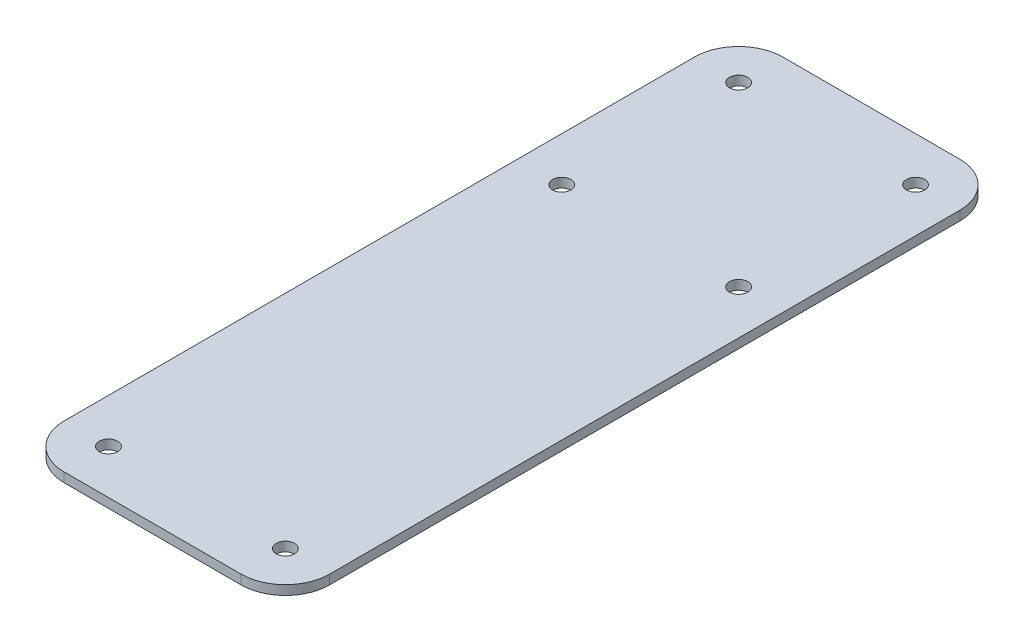
ISO-10303-21;
HEADER;
FILE_DESCRIPTION(('STEP AP214'),'2;1');
FILE_NAME('part.step','',(''),(''),'','','');
FILE_SCHEMA(('AUTOMOTIVE_DESIGN { 1 0 10303 214 1 1 1 1 }'));
ENDSEC;
DATA;
#1=APPLICATION_CONTEXT('core data for automotive mechanical design processes');
#2=APPLICATION_PROTOCOL_DEFINITION('international standard','automotive_design',2000,#1);
#3=PRODUCT_CONTEXT('',#1,'mechanical');
#4=PRODUCT('Part','Part','',(#3));
#5=PRODUCT_RELATED_PRODUCT_CATEGORY('part','',(#4));
#6=PRODUCT_DEFINITION_FORMATION('','',#4);
#7=PRODUCT_DEFINITION_CONTEXT('part definition',#1,'design');
#8=PRODUCT_DEFINITION('design','',#6,#7);
#9=PRODUCT_DEFINITION_SHAPE('','',#8);
#10=(LENGTH_UNIT() NAMED_UNIT(*) SI_UNIT(.MILLI.,.METRE.));
#11=(NAMED_UNIT(*) PLANE_ANGLE_UNIT() SI_UNIT($,.RADIAN.));
#12=(NAMED_UNIT(*) SI_UNIT($,.STERADIAN.) SOLID_ANGLE_UNIT());
#13=UNCERTAINTY_MEASURE_WITH_UNIT(LENGTH_MEASURE(1.E-05),#10,'distance_accuracy_value','');
#14=(GEOMETRIC_REPRESENTATION_CONTEXT(3) GLOBAL_UNCERTAINTY_ASSIGNED_CONTEXT((#13)) GLOBAL_UNIT_ASSIGNED_CONTEXT((#10,
#11,#12)) REPRESENTATION_CONTEXT('',''));
#15=CARTESIAN_POINT('',(0.,0.,0.));
#16=DIRECTION('',(0.,0.,1.));
#17=DIRECTION('',(1.,0.,0.));
#18=AXIS2_PLACEMENT_3D('',#15,#16,#17);
#19=CARTESIAN_POINT('',(30.,-169.175,183.7293));
#20=DIRECTION('',(0.,1.,0.));
#21=DIRECTION('',(-1.,0.,0.));
#22=AXIS2_PLACEMENT_3D('',#19,#20,#21);
#23=PLANE('',#22);
#24=CARTESIAN_POINT('',(30.,-169.175,183.7293));
#25=DIRECTION('',(0.,-1.,0.));
#26=DIRECTION('',(-1.,0.,0.));
#27=AXIS2_PLACEMENT_3D('',#24,#25,#26);
#28=CIRCLE('',#27,15.);
#29=CARTESIAN_POINT('',(45.,-169.175,183.7293));
#30=VERTEX_POINT('',#29);
#31=CARTESIAN_POINT('',(30.,-169.175,198.7293));
#32=VERTEX_POINT('',#31);
#33=EDGE_CURVE('E147',#30,#32,#28,.T.);
#34=ORIENTED_EDGE('',*,*,#33,.T.);
#35=DIRECTION('',(-1.,0.,0.));
#36=VECTOR('',#35,1.);
#37=CARTESIAN_POINT('',(30.,-169.175,198.7293));
#38=LINE('',#37,#36);
#39=CARTESIAN_POINT('',(-30.,-169.175,198.7293));
#40=VERTEX_POINT('',#39);
#41=EDGE_CURVE('E95',#32,#40,#38,.T.);
#42=ORIENTED_EDGE('',*,*,#41,.T.);
#43=CARTESIAN_POINT('',(-30.,-169.175,183.7293));
#44=DIRECTION('',(0.,-1.,0.));
#45=DIRECTION('',(-1.,0.,0.));
#46=AXIS2_PLACEMENT_3D('',#43,#44,#45);
#47=CIRCLE('',#46,15.);
#48=CARTESIAN_POINT('',(-45.,-169.175,183.7293));
#49=VERTEX_POINT('',#48);
#50=EDGE_CURVE('E162',#40,#49,#47,.T.);
#51=ORIENTED_EDGE('',*,*,#50,.T.);
#52=DIRECTION('',(0.,0.,-1.));
#53=VECTOR('',#52,1.);
#54=CARTESIAN_POINT('',(-45.,-169.175,-30.));
#55=LINE('',#54,#53);
#56=CARTESIAN_POINT('',(-45.,-169.175,-30.));
#57=VERTEX_POINT('',#56);
#58=EDGE_CURVE('E175',#49,#57,#55,.T.);
#59=ORIENTED_EDGE('',*,*,#58,.T.);
#60=CARTESIAN_POINT('',(-30.,-169.175,-30.));
#61=DIRECTION('',(0.,-1.,0.));
#62=DIRECTION('',(1.,0.,0.));
#63=AXIS2_PLACEMENT_3D('',#60,#61,#62);
#64=CIRCLE('',#63,15.);
#65=CARTESIAN_POINT('',(-30.,-169.175,-45.));
#66=VERTEX_POINT('',#65);
#67=EDGE_CURVE('E114',#57,#66,#64,.T.);
#68=ORIENTED_EDGE('',*,*,#67,.T.);
#69=DIRECTION('',(1.,0.,0.));
#70=VECTOR('',#69,1.);
#71=CARTESIAN_POINT('',(-30.,-169.175,-45.));
#72=LINE('',#71,#70);
#73=CARTESIAN_POINT('',(30.,-169.175,-45.));
#74=VERTEX_POINT('',#73);
#75=EDGE_CURVE('E108',#66,#74,#72,.T.);
#76=ORIENTED_EDGE('',*,*,#75,.T.);
#77=CARTESIAN_POINT('',(30.,-169.175,-30.));
#78=DIRECTION('',(0.,-1.,0.));
#79=DIRECTION('',(1.,0.,0.));
#80=AXIS2_PLACEMENT_3D('',#77,#78,#79);
#81=CIRCLE('',#80,15.);
#82=CARTESIAN_POINT('',(45.,-169.175,-30.));
#83=VERTEX_POINT('',#82);
#84=EDGE_CURVE('E112',#74,#83,#81,.T.);
#85=ORIENTED_EDGE('',*,*,#84,.T.);
#86=DIRECTION('',(0.,0.,1.));
#87=VECTOR('',#86,1.);
#88=CARTESIAN_POINT('',(45.,-169.175,183.7293));
#89=LINE('',#88,#87);
#90=EDGE_CURVE('E52',#83,#30,#89,.T.);
#91=ORIENTED_EDGE('',*,*,#90,.T.);
#92=EDGE_LOOP('',(#34,#42,#51,#59,#68,#76,#85,#91));
#93=FACE_BOUND('',#92,.T.);
#94=CARTESIAN_POINT('',(30.,-169.175,183.7293));
#95=DIRECTION('',(0.,-1.,0.));
#96=DIRECTION('',(1.,0.,0.));
#97=AXIS2_PLACEMENT_3D('',#94,#95,#96);
#98=CIRCLE('',#97,3.09999999999999);
#99=CARTESIAN_POINT('',(33.1,-169.175,183.7293));
#100=VERTEX_POINT('',#99);
#101=EDGE_CURVE('E136',#100,#100,#98,.T.);
#102=ORIENTED_EDGE('',*,*,#101,.F.);
#103=EDGE_LOOP('',(#102));
#104=FACE_BOUND('',#103,.T.);
#105=CARTESIAN_POINT('',(30.,-169.175,-30.));
#106=DIRECTION('',(0.,-1.,0.));
#107=DIRECTION('',(1.,0.,0.));
#108=AXIS2_PLACEMENT_3D('',#105,#106,#107);
#109=CIRCLE('',#108,3.1);
#110=CARTESIAN_POINT('',(33.1,-169.175,-30.));
#111=VERTEX_POINT('',#110);
#112=EDGE_CURVE('E184',#111,#111,#109,.T.);
#113=ORIENTED_EDGE('',*,*,#112,.F.);
#114=EDGE_LOOP('',(#113));
#115=FACE_BOUND('',#114,.T.);
#116=CARTESIAN_POINT('',(-30.,-169.175,-30.));
#117=DIRECTION('',(0.,-1.,0.));
#118=DIRECTION('',(1.,0.,0.));
#119=AXIS2_PLACEMENT_3D('',#116,#117,#118);
#120=CIRCLE('',#119,3.1);
#121=CARTESIAN_POINT('',(-26.9,-169.175,-30.));
#122=VERTEX_POINT('',#121);
#123=EDGE_CURVE('E190',#122,#122,#120,.T.);
#124=ORIENTED_EDGE('',*,*,#123,.F.);
#125=EDGE_LOOP('',(#124));
#126=FACE_BOUND('',#125,.T.);
#127=CARTESIAN_POINT('',(-30.,-169.175,30.));
#128=DIRECTION('',(0.,-1.,0.));
#129=DIRECTION('',(1.,0.,0.));
#130=AXIS2_PLACEMENT_3D('',#127,#128,#129);
#131=CIRCLE('',#130,3.1);
#132=CARTESIAN_POINT('',(-26.9,-169.175,30.));
#133=VERTEX_POINT('',#132);
#134=EDGE_CURVE('E196',#133,#133,#131,.T.);
#135=ORIENTED_EDGE('',*,*,#134,.F.);
#136=EDGE_LOOP('',(#135));
#137=FACE_BOUND('',#136,.T.);
#138=CARTESIAN_POINT('',(30.,-169.175,30.));
#139=DIRECTION('',(0.,-1.,0.));
#140=DIRECTION('',(1.,0.,0.));
#141=AXIS2_PLACEMENT_3D('',#138,#139,#140);
#142=CIRCLE('',#141,3.1);
#143=CARTESIAN_POINT('',(33.1,-169.175,30.));
#144=VERTEX_POINT('',#143);
#145=EDGE_CURVE('E202',#144,#144,#142,.T.);
#146=ORIENTED_EDGE('',*,*,#145,.F.);
#147=EDGE_LOOP('',(#146));
#148=FACE_BOUND('',#147,.T.);
#149=CARTESIAN_POINT('',(-30.,-169.175,183.7293));
#150=DIRECTION('',(0.,-1.,0.));
#151=DIRECTION('',(1.,0.,0.));
#152=AXIS2_PLACEMENT_3D('',#149,#150,#151);
#153=CIRCLE('',#152,3.09999999999999);
#154=CARTESIAN_POINT('',(-26.9,-169.175,183.7293));
#155=VERTEX_POINT('',#154);
#156=EDGE_CURVE('E208',#155,#155,#153,.T.);
#157=ORIENTED_EDGE('',*,*,#156,.F.);
#158=EDGE_LOOP('',(#157));
#159=FACE_BOUND('',#158,.T.);
#160=ADVANCED_FACE('F35',(#93,#104,#115,#126,#137,#148,#159),#23,.F.);
#161=CARTESIAN_POINT('',(30.,-166.,183.7293));
#162=DIRECTION('',(0.,1.,0.));
#163=DIRECTION('',(-1.,0.,0.));
#164=AXIS2_PLACEMENT_3D('',#161,#162,#163);
#165=PLANE('',#164);
#166=CARTESIAN_POINT('',(30.,-166.,30.));
#167=DIRECTION('',(0.,-1.,0.));
#168=DIRECTION('',(1.,0.,0.));
#169=AXIS2_PLACEMENT_3D('',#166,#167,#168);
#170=CIRCLE('',#169,3.1);
#171=CARTESIAN_POINT('',(33.1,-166.,30.));
#172=VERTEX_POINT('',#171);
#173=EDGE_CURVE('E205',#172,#172,#170,.T.);
#174=ORIENTED_EDGE('',*,*,#173,.T.);
#175=EDGE_LOOP('',(#174));
#176=FACE_BOUND('',#175,.T.);
#177=CARTESIAN_POINT('',(-30.,-166.,-30.));
#178=DIRECTION('',(0.,-1.,0.));
#179=DIRECTION('',(1.,0.,0.));
#180=AXIS2_PLACEMENT_3D('',#177,#178,#179);
#181=CIRCLE('',#180,3.1);
#182=CARTESIAN_POINT('',(-26.9,-166.,-30.));
#183=VERTEX_POINT('',#182);
#184=EDGE_CURVE('E193',#183,#183,#181,.T.);
#185=ORIENTED_EDGE('',*,*,#184,.T.);
#186=EDGE_LOOP('',(#185));
#187=FACE_BOUND('',#186,.T.);
#188=CARTESIAN_POINT('',(30.,-166.,183.7293));
#189=DIRECTION('',(0.,-1.,0.));
#190=DIRECTION('',(1.,0.,0.));
#191=AXIS2_PLACEMENT_3D('',#188,#189,#190);
#192=CIRCLE('',#191,3.09999999999999);
#193=CARTESIAN_POINT('',(33.1,-166.,183.7293));
#194=VERTEX_POINT('',#193);
#195=EDGE_CURVE('E181',#194,#194,#192,.T.);
#196=ORIENTED_EDGE('',*,*,#195,.T.);
#197=EDGE_LOOP('',(#196));
#198=FACE_BOUND('',#197,.T.);
#199=CARTESIAN_POINT('',(30.,-166.,183.7293));
#200=DIRECTION('',(0.,-1.,0.));
#201=DIRECTION('',(-1.,0.,0.));
#202=AXIS2_PLACEMENT_3D('',#199,#200,#201);
#203=CIRCLE('',#202,15.);
#204=CARTESIAN_POINT('',(45.,-166.,183.7293));
#205=VERTEX_POINT('',#204);
#206=CARTESIAN_POINT('',(30.,-166.,198.7293));
#207=VERTEX_POINT('',#206);
#208=EDGE_CURVE('E132',#205,#207,#203,.T.);
#209=ORIENTED_EDGE('',*,*,#208,.F.);
#210=DIRECTION('',(0.,0.,1.));
#211=VECTOR('',#210,1.);
#212=CARTESIAN_POINT('',(45.,-166.,183.7293));
#213=LINE('',#212,#211);
#214=CARTESIAN_POINT('',(45.,-166.,-30.));
#215=VERTEX_POINT('',#214);
#216=EDGE_CURVE('E87',#215,#205,#213,.T.);
#217=ORIENTED_EDGE('',*,*,#216,.F.);
#218=CARTESIAN_POINT('',(30.,-166.,-30.));
#219=DIRECTION('',(0.,-1.,0.));
#220=DIRECTION('',(1.,0.,0.));
#221=AXIS2_PLACEMENT_3D('',#218,#219,#220);
#222=CIRCLE('',#221,15.);
#223=CARTESIAN_POINT('',(30.,-166.,-45.));
#224=VERTEX_POINT('',#223);
#225=EDGE_CURVE('E81',#224,#215,#222,.T.);
#226=ORIENTED_EDGE('',*,*,#225,.F.);
#227=DIRECTION('',(1.,0.,0.));
#228=VECTOR('',#227,1.);
#229=CARTESIAN_POINT('',(-30.,-166.,-45.));
#230=LINE('',#229,#228);
#231=CARTESIAN_POINT('',(-30.,-166.,-45.));
#232=VERTEX_POINT('',#231);
#233=EDGE_CURVE('E122',#232,#224,#230,.T.);
#234=ORIENTED_EDGE('',*,*,#233,.F.);
#235=CARTESIAN_POINT('',(-30.,-166.,-30.));
#236=DIRECTION('',(0.,-1.,0.));
#237=DIRECTION('',(1.,0.,0.));
#238=AXIS2_PLACEMENT_3D('',#235,#236,#237);
#239=CIRCLE('',#238,15.);
#240=CARTESIAN_POINT('',(-45.,-166.,-30.));
#241=VERTEX_POINT('',#240);
#242=EDGE_CURVE('E142',#241,#232,#239,.T.);
#243=ORIENTED_EDGE('',*,*,#242,.F.);
#244=DIRECTION('',(0.,0.,-1.));
#245=VECTOR('',#244,1.);
#246=CARTESIAN_POINT('',(-45.,-166.,-30.));
#247=LINE('',#246,#245);
#248=CARTESIAN_POINT('',(-45.,-166.,183.7293));
#249=VERTEX_POINT('',#248);
#250=EDGE_CURVE('E140',#249,#241,#247,.T.);
#251=ORIENTED_EDGE('',*,*,#250,.F.);
#252=CARTESIAN_POINT('',(-30.,-166.,183.7293));
#253=DIRECTION('',(0.,-1.,0.));
#254=DIRECTION('',(-1.,0.,0.));
#255=AXIS2_PLACEMENT_3D('',#252,#253,#254);
#256=CIRCLE('',#255,15.);
#257=CARTESIAN_POINT('',(-30.,-166.,198.7293));
#258=VERTEX_POINT('',#257);
#259=EDGE_CURVE('E138',#258,#249,#256,.T.);
#260=ORIENTED_EDGE('',*,*,#259,.F.);
#261=DIRECTION('',(-1.,0.,0.));
#262=VECTOR('',#261,1.);
#263=CARTESIAN_POINT('',(30.,-166.,198.7293));
#264=LINE('',#263,#262);
#265=EDGE_CURVE('E135',#207,#258,#264,.T.);
#266=ORIENTED_EDGE('',*,*,#265,.F.);
#267=EDGE_LOOP('',(#209,#217,#226,#234,#243,#251,#260,#266));
#268=FACE_BOUND('',#267,.T.);
#269=CARTESIAN_POINT('',(30.,-166.,-30.));
#270=DIRECTION('',(0.,-1.,0.));
#271=DIRECTION('',(1.,0.,0.));
#272=AXIS2_PLACEMENT_3D('',#269,#270,#271);
#273=CIRCLE('',#272,3.1);
#274=CARTESIAN_POINT('',(33.1,-166.,-30.));
#275=VERTEX_POINT('',#274);
#276=EDGE_CURVE('E187',#275,#275,#273,.T.);
#277=ORIENTED_EDGE('',*,*,#276,.T.);
#278=EDGE_LOOP('',(#277));
#279=FACE_BOUND('',#278,.T.);
#280=CARTESIAN_POINT('',(-30.,-166.,30.));
#281=DIRECTION('',(0.,-1.,0.));
#282=DIRECTION('',(1.,0.,0.));
#283=AXIS2_PLACEMENT_3D('',#280,#281,#282);
#284=CIRCLE('',#283,3.1);
#285=CARTESIAN_POINT('',(-26.9,-166.,30.));
#286=VERTEX_POINT('',#285);
#287=EDGE_CURVE('E199',#286,#286,#284,.T.);
#288=ORIENTED_EDGE('',*,*,#287,.T.);
#289=EDGE_LOOP('',(#288));
#290=FACE_BOUND('',#289,.T.);
#291=CARTESIAN_POINT('',(-30.,-166.,183.7293));
#292=DIRECTION('',(0.,-1.,0.));
#293=DIRECTION('',(1.,0.,0.));
#294=AXIS2_PLACEMENT_3D('',#291,#292,#293);
#295=CIRCLE('',#294,3.09999999999999);
#296=CARTESIAN_POINT('',(-26.9,-166.,183.7293));
#297=VERTEX_POINT('',#296);
#298=EDGE_CURVE('E211',#297,#297,#295,.T.);
#299=ORIENTED_EDGE('',*,*,#298,.T.);
#300=EDGE_LOOP('',(#299));
#301=FACE_BOUND('',#300,.T.);
#302=ADVANCED_FACE('F166',(#176,#187,#198,#268,#279,#290,#301),#165,.T.);
#303=CARTESIAN_POINT('',(30.,-169.175,183.7293));
#304=DIRECTION('',(0.,1.,0.));
#305=DIRECTION('',(-1.,0.,0.));
#306=AXIS2_PLACEMENT_3D('',#303,#304,#305);
#307=CYLINDRICAL_SURFACE('',#306,15.);
#308=ORIENTED_EDGE('',*,*,#208,.T.);
#309=DIRECTION('',(0.,1.,0.));
#310=VECTOR('',#309,1.);
#311=CARTESIAN_POINT('',(30.,-169.175,198.7293));
#312=LINE('',#311,#310);
#313=EDGE_CURVE('E12',#32,#207,#312,.T.);
#314=ORIENTED_EDGE('',*,*,#313,.F.);
#315=ORIENTED_EDGE('',*,*,#33,.F.);
#316=DIRECTION('',(0.,1.,0.));
#317=VECTOR('',#316,1.);
#318=CARTESIAN_POINT('',(45.,-169.175,183.7293));
#319=LINE('',#318,#317);
#320=EDGE_CURVE('E128',#30,#205,#319,.T.);
#321=ORIENTED_EDGE('',*,*,#320,.T.);
#322=EDGE_LOOP('',(#308,#314,#315,#321));
#323=FACE_BOUND('',#322,.T.);
#324=ADVANCED_FACE('F37',(#323),#307,.T.);
#325=CARTESIAN_POINT('',(30.,-169.175,198.7293));
#326=DIRECTION('',(0.,0.,-1.));
#327=DIRECTION('',(-1.,0.,0.));
#328=AXIS2_PLACEMENT_3D('',#325,#326,#327);
#329=PLANE('',#328);
#330=ORIENTED_EDGE('',*,*,#265,.T.);
#331=DIRECTION('',(0.,1.,0.));
#332=VECTOR('',#331,1.);
#333=CARTESIAN_POINT('',(-30.,-169.175,198.7293));
#334=LINE('',#333,#332);
#335=EDGE_CURVE('E44',#40,#258,#334,.T.);
#336=ORIENTED_EDGE('',*,*,#335,.F.);
#337=ORIENTED_EDGE('',*,*,#41,.F.);
#338=ORIENTED_EDGE('',*,*,#313,.T.);
#339=EDGE_LOOP('',(#330,#336,#337,#338));
#340=FACE_BOUND('',#339,.T.);
#341=ADVANCED_FACE('F243',(#340),#329,.F.);
#342=CARTESIAN_POINT('',(-30.,-169.175,183.7293));
#343=DIRECTION('',(0.,1.,0.));
#344=DIRECTION('',(-1.,0.,0.));
#345=AXIS2_PLACEMENT_3D('',#342,#343,#344);
#346=CYLINDRICAL_SURFACE('',#345,15.);
#347=ORIENTED_EDGE('',*,*,#259,.T.);
#348=DIRECTION('',(0.,1.,0.));
#349=VECTOR('',#348,1.);
#350=CARTESIAN_POINT('',(-45.,-169.175,183.7293));
#351=LINE('',#350,#349);
#352=EDGE_CURVE('E154',#49,#249,#351,.T.);
#353=ORIENTED_EDGE('',*,*,#352,.F.);
#354=ORIENTED_EDGE('',*,*,#50,.F.);
#355=ORIENTED_EDGE('',*,*,#335,.T.);
#356=EDGE_LOOP('',(#347,#353,#354,#355));
#357=FACE_BOUND('',#356,.T.);
#358=ADVANCED_FACE('F160',(#357),#346,.T.);
#359=CARTESIAN_POINT('',(-45.,-169.175,-30.));
#360=DIRECTION('',(1.,0.,0.));
#361=DIRECTION('',(0.,1.,0.));
#362=AXIS2_PLACEMENT_3D('',#359,#360,#361);
#363=PLANE('',#362);
#364=ORIENTED_EDGE('',*,*,#250,.T.);
#365=DIRECTION('',(0.,1.,0.));
#366=VECTOR('',#365,1.);
#367=CARTESIAN_POINT('',(-45.,-169.175,-30.));
#368=LINE('',#367,#366);
#369=EDGE_CURVE('E151',#57,#241,#368,.T.);
#370=ORIENTED_EDGE('',*,*,#369,.F.);
#371=ORIENTED_EDGE('',*,*,#58,.F.);
#372=ORIENTED_EDGE('',*,*,#352,.T.);
#373=EDGE_LOOP('',(#364,#370,#371,#372));
#374=FACE_BOUND('',#373,.T.);
#375=ADVANCED_FACE('F171',(#374),#363,.F.);
#376=CARTESIAN_POINT('',(-30.,-169.175,-30.));
#377=DIRECTION('',(0.,1.,0.));
#378=DIRECTION('',(-1.,0.,0.));
#379=AXIS2_PLACEMENT_3D('',#376,#377,#378);
#380=CYLINDRICAL_SURFACE('',#379,15.);
#381=ORIENTED_EDGE('',*,*,#242,.T.);
#382=DIRECTION('',(0.,1.,0.));
#383=VECTOR('',#382,1.);
#384=CARTESIAN_POINT('',(-30.,-169.175,-45.));
#385=LINE('',#384,#383);
#386=EDGE_CURVE('E123',#66,#232,#385,.T.);
#387=ORIENTED_EDGE('',*,*,#386,.F.);
#388=ORIENTED_EDGE('',*,*,#67,.F.);
#389=ORIENTED_EDGE('',*,*,#369,.T.);
#390=EDGE_LOOP('',(#381,#387,#388,#389));
#391=FACE_BOUND('',#390,.T.);
#392=ADVANCED_FACE('F174',(#391),#380,.T.);
#393=CARTESIAN_POINT('',(-30.,-169.175,-45.));
#394=DIRECTION('',(0.,0.,1.));
#395=DIRECTION('',(1.,0.,0.));
#396=AXIS2_PLACEMENT_3D('',#393,#394,#395);
#397=PLANE('',#396);
#398=ORIENTED_EDGE('',*,*,#233,.T.);
#399=DIRECTION('',(0.,1.,0.));
#400=VECTOR('',#399,1.);
#401=CARTESIAN_POINT('',(30.,-169.175,-45.));
#402=LINE('',#401,#400);
#403=EDGE_CURVE('E119',#74,#224,#402,.T.);
#404=ORIENTED_EDGE('',*,*,#403,.F.);
#405=ORIENTED_EDGE('',*,*,#75,.F.);
#406=ORIENTED_EDGE('',*,*,#386,.T.);
#407=EDGE_LOOP('',(#398,#404,#405,#406));
#408=FACE_BOUND('',#407,.T.);
#409=ADVANCED_FACE('F120',(#408),#397,.F.);
#410=CARTESIAN_POINT('',(30.,-169.175,-30.));
#411=DIRECTION('',(0.,1.,0.));
#412=DIRECTION('',(-1.,0.,0.));
#413=AXIS2_PLACEMENT_3D('',#410,#411,#412);
#414=CYLINDRICAL_SURFACE('',#413,15.);
#415=ORIENTED_EDGE('',*,*,#225,.T.);
#416=DIRECTION('',(0.,1.,0.));
#417=VECTOR('',#416,1.);
#418=CARTESIAN_POINT('',(45.,-169.175,-30.));
#419=LINE('',#418,#417);
#420=EDGE_CURVE('E124',#83,#215,#419,.T.);
#421=ORIENTED_EDGE('',*,*,#420,.F.);
#422=ORIENTED_EDGE('',*,*,#84,.F.);
#423=ORIENTED_EDGE('',*,*,#403,.T.);
#424=EDGE_LOOP('',(#415,#421,#422,#423));
#425=FACE_BOUND('',#424,.T.);
#426=ADVANCED_FACE('F126',(#425),#414,.T.);
#427=CARTESIAN_POINT('',(45.,-169.175,183.7293));
#428=DIRECTION('',(-1.,0.,0.));
#429=DIRECTION('',(0.,-1.,0.));
#430=AXIS2_PLACEMENT_3D('',#427,#428,#429);
#431=PLANE('',#430);
#432=ORIENTED_EDGE('',*,*,#216,.T.);
#433=ORIENTED_EDGE('',*,*,#320,.F.);
#434=ORIENTED_EDGE('',*,*,#90,.F.);
#435=ORIENTED_EDGE('',*,*,#420,.T.);
#436=EDGE_LOOP('',(#432,#433,#434,#435));
#437=FACE_BOUND('',#436,.T.);
#438=ADVANCED_FACE('F231',(#437),#431,.F.);
#439=CARTESIAN_POINT('',(30.,-169.175,183.7293));
#440=DIRECTION('',(0.,1.,0.));
#441=DIRECTION('',(-1.,0.,0.));
#442=AXIS2_PLACEMENT_3D('',#439,#440,#441);
#443=CYLINDRICAL_SURFACE('',#442,3.09999999999999);
#444=ORIENTED_EDGE('',*,*,#101,.T.);
#445=EDGE_LOOP('',(#444));
#446=FACE_BOUND('',#445,.T.);
#447=ORIENTED_EDGE('',*,*,#195,.F.);
#448=EDGE_LOOP('',(#447));
#449=FACE_BOUND('',#448,.T.);
#450=ADVANCED_FACE('F228',(#446,#449),#443,.F.);
#451=CARTESIAN_POINT('',(30.,-169.175,-30.));
#452=DIRECTION('',(0.,1.,0.));
#453=DIRECTION('',(-1.,0.,0.));
#454=AXIS2_PLACEMENT_3D('',#451,#452,#453);
#455=CYLINDRICAL_SURFACE('',#454,3.1);
#456=ORIENTED_EDGE('',*,*,#112,.T.);
#457=EDGE_LOOP('',(#456));
#458=FACE_BOUND('',#457,.T.);
#459=ORIENTED_EDGE('',*,*,#276,.F.);
#460=EDGE_LOOP('',(#459));
#461=FACE_BOUND('',#460,.T.);
#462=ADVANCED_FACE('F306',(#458,#461),#455,.F.);
#463=CARTESIAN_POINT('',(-30.,-169.175,-30.));
#464=DIRECTION('',(0.,1.,0.));
#465=DIRECTION('',(-1.,0.,0.));
#466=AXIS2_PLACEMENT_3D('',#463,#464,#465);
#467=CYLINDRICAL_SURFACE('',#466,3.1);
#468=ORIENTED_EDGE('',*,*,#123,.T.);
#469=EDGE_LOOP('',(#468));
#470=FACE_BOUND('',#469,.T.);
#471=ORIENTED_EDGE('',*,*,#184,.F.);
#472=EDGE_LOOP('',(#471));
#473=FACE_BOUND('',#472,.T.);
#474=ADVANCED_FACE('F314',(#470,#473),#467,.F.);
#475=CARTESIAN_POINT('',(-30.,-169.175,30.));
#476=DIRECTION('',(0.,1.,0.));
#477=DIRECTION('',(-1.,0.,0.));
#478=AXIS2_PLACEMENT_3D('',#475,#476,#477);
#479=CYLINDRICAL_SURFACE('',#478,3.1);
#480=ORIENTED_EDGE('',*,*,#134,.T.);
#481=EDGE_LOOP('',(#480));
#482=FACE_BOUND('',#481,.T.);
#483=ORIENTED_EDGE('',*,*,#287,.F.);
#484=EDGE_LOOP('',(#483));
#485=FACE_BOUND('',#484,.T.);
#486=ADVANCED_FACE('F322',(#482,#485),#479,.F.);
#487=CARTESIAN_POINT('',(30.,-169.175,30.));
#488=DIRECTION('',(0.,1.,0.));
#489=DIRECTION('',(-1.,0.,0.));
#490=AXIS2_PLACEMENT_3D('',#487,#488,#489);
#491=CYLINDRICAL_SURFACE('',#490,3.1);
#492=ORIENTED_EDGE('',*,*,#145,.T.);
#493=EDGE_LOOP('',(#492));
#494=FACE_BOUND('',#493,.T.);
#495=ORIENTED_EDGE('',*,*,#173,.F.);
#496=EDGE_LOOP('',(#495));
#497=FACE_BOUND('',#496,.T.);
#498=ADVANCED_FACE('F331',(#494,#497),#491,.F.);
#499=CARTESIAN_POINT('',(-30.,-169.175,183.7293));
#500=DIRECTION('',(0.,1.,0.));
#501=DIRECTION('',(-1.,0.,0.));
#502=AXIS2_PLACEMENT_3D('',#499,#500,#501);
#503=CYLINDRICAL_SURFACE('',#502,3.09999999999999);
#504=ORIENTED_EDGE('',*,*,#156,.T.);
#505=EDGE_LOOP('',(#504));
#506=FACE_BOUND('',#505,.T.);
#507=ORIENTED_EDGE('',*,*,#298,.F.);
#508=EDGE_LOOP('',(#507));
#509=FACE_BOUND('',#508,.T.);
#510=ADVANCED_FACE('F217',(#506,#509),#503,.F.);
#511=CLOSED_SHELL('',(#160,#302,#324,#341,#358,#375,#392,#409,#426,#438,#450,#462,#474,#486,
#498,#510));
#512=MANIFOLD_SOLID_BREP('B2',#511);
#513=ADVANCED_BREP_SHAPE_REPRESENTATION('',(#18,#512),#14);
#514=SHAPE_DEFINITION_REPRESENTATION(#9,#513);
ENDSEC;
END-ISO-10303-21;
